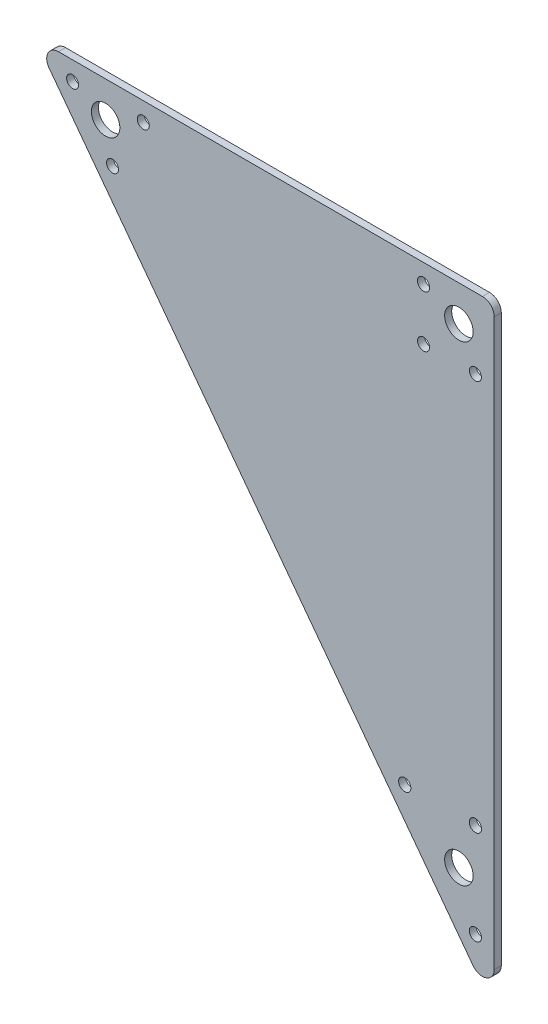
ISO-10303-21;
HEADER;
FILE_DESCRIPTION(('STEP AP214'),'2;1');
FILE_NAME('part.step','',(''),(''),'','','');
FILE_SCHEMA(('AUTOMOTIVE_DESIGN { 1 0 10303 214 1 1 1 1 }'));
ENDSEC;
DATA;
#1=APPLICATION_CONTEXT('core data for automotive mechanical design processes');
#2=APPLICATION_PROTOCOL_DEFINITION('international standard','automotive_design',2000,#1);
#3=PRODUCT_CONTEXT('',#1,'mechanical');
#4=PRODUCT('Part','Part','',(#3));
#5=PRODUCT_RELATED_PRODUCT_CATEGORY('part','',(#4));
#6=PRODUCT_DEFINITION_FORMATION('','',#4);
#7=PRODUCT_DEFINITION_CONTEXT('part definition',#1,'design');
#8=PRODUCT_DEFINITION('design','',#6,#7);
#9=PRODUCT_DEFINITION_SHAPE('','',#8);
#10=(LENGTH_UNIT() NAMED_UNIT(*) SI_UNIT(.MILLI.,.METRE.));
#11=(NAMED_UNIT(*) PLANE_ANGLE_UNIT() SI_UNIT($,.RADIAN.));
#12=(NAMED_UNIT(*) SI_UNIT($,.STERADIAN.) SOLID_ANGLE_UNIT());
#13=UNCERTAINTY_MEASURE_WITH_UNIT(LENGTH_MEASURE(1.E-05),#10,'distance_accuracy_value','');
#14=(GEOMETRIC_REPRESENTATION_CONTEXT(3) GLOBAL_UNCERTAINTY_ASSIGNED_CONTEXT((#13)) GLOBAL_UNIT_ASSIGNED_CONTEXT((#10,
#11,#12)) REPRESENTATION_CONTEXT('',''));
#15=CARTESIAN_POINT('',(0.,0.,0.));
#16=DIRECTION('',(0.,0.,1.));
#17=DIRECTION('',(1.,0.,0.));
#18=AXIS2_PLACEMENT_3D('',#15,#16,#17);
#19=CARTESIAN_POINT('',(0.,0.,3.));
#20=DIRECTION('',(0.,0.,1.));
#21=DIRECTION('',(1.,0.,0.));
#22=AXIS2_PLACEMENT_3D('',#19,#20,#21);
#23=PLANE('',#22);
#24=CARTESIAN_POINT('',(-23.,-181.,3.));
#25=DIRECTION('',(0.,0.,1.));
#26=DIRECTION('',(1.,0.,0.));
#27=AXIS2_PLACEMENT_3D('',#24,#25,#26);
#28=CIRCLE('',#27,2.6);
#29=CARTESIAN_POINT('',(-20.4,-181.,3.));
#30=VERTEX_POINT('',#29);
#31=EDGE_CURVE('E183',#30,#30,#28,.T.);
#32=ORIENTED_EDGE('',*,*,#31,.F.);
#33=EDGE_LOOP('',(#32));
#34=FACE_BOUND('',#33,.T.);
#35=CARTESIAN_POINT('',(-147.048935520436,-15.6014193060854,3.));
#36=DIRECTION('',(0.,0.,1.));
#37=DIRECTION('',(1.,0.,0.));
#38=AXIS2_PLACEMENT_3D('',#35,#36,#37);
#39=CIRCLE('',#38,2.54999999999999);
#40=CARTESIAN_POINT('',(-144.498935520436,-15.6014193060854,3.));
#41=VERTEX_POINT('',#40);
#42=EDGE_CURVE('E195',#41,#41,#39,.T.);
#43=ORIENTED_EDGE('',*,*,#42,.F.);
#44=EDGE_LOOP('',(#43));
#45=FACE_BOUND('',#44,.T.);
#46=CARTESIAN_POINT('',(-164.,7.,3.));
#47=DIRECTION('',(0.,0.,1.));
#48=DIRECTION('',(1.,0.,0.));
#49=AXIS2_PLACEMENT_3D('',#46,#47,#48);
#50=CIRCLE('',#49,2.54999999999999);
#51=CARTESIAN_POINT('',(-161.45,7.,3.));
#52=VERTEX_POINT('',#51);
#53=EDGE_CURVE('E205',#52,#52,#50,.T.);
#54=ORIENTED_EDGE('',*,*,#53,.F.);
#55=EDGE_LOOP('',(#54));
#56=FACE_BOUND('',#55,.T.);
#57=CARTESIAN_POINT('',(-15.,-15.,3.));
#58=DIRECTION('',(0.,0.,1.));
#59=DIRECTION('',(1.,0.,0.));
#60=AXIS2_PLACEMENT_3D('',#57,#58,#59);
#61=CIRCLE('',#60,2.54999999999999);
#62=CARTESIAN_POINT('',(-12.45,-15.,3.));
#63=VERTEX_POINT('',#62);
#64=EDGE_CURVE('E215',#63,#63,#61,.T.);
#65=ORIENTED_EDGE('',*,*,#64,.F.);
#66=EDGE_LOOP('',(#65));
#67=FACE_BOUND('',#66,.T.);
#68=CARTESIAN_POINT('',(0.,-200.,3.));
#69=DIRECTION('',(0.,0.,1.));
#70=DIRECTION('',(1.,0.,0.));
#71=AXIS2_PLACEMENT_3D('',#68,#69,#70);
#72=CIRCLE('',#71,6.05);
#73=CARTESIAN_POINT('',(6.05000000000002,-200.,3.));
#74=VERTEX_POINT('',#73);
#75=EDGE_CURVE('E225',#74,#74,#72,.T.);
#76=ORIENTED_EDGE('',*,*,#75,.F.);
#77=EDGE_LOOP('',(#76));
#78=FACE_BOUND('',#77,.T.);
#79=CARTESIAN_POINT('',(0.,0.,3.));
#80=DIRECTION('',(0.,0.,1.));
#81=DIRECTION('',(1.,0.,0.));
#82=AXIS2_PLACEMENT_3D('',#79,#80,#81);
#83=CIRCLE('',#82,6.05);
#84=CARTESIAN_POINT('',(6.05,0.,3.));
#85=VERTEX_POINT('',#84);
#86=EDGE_CURVE('E119',#85,#85,#83,.T.);
#87=ORIENTED_EDGE('',*,*,#86,.F.);
#88=EDGE_LOOP('',(#87));
#89=FACE_BOUND('',#88,.T.);
#90=DIRECTION('',(0.6,-0.8,0.));
#91=VECTOR('',#90,1.);
#92=CARTESIAN_POINT('',(-180.,15.,3.));
#93=LINE('',#92,#91);
#94=CARTESIAN_POINT('',(-174.,6.99999999999999,3.));
#95=VERTEX_POINT('',#94);
#96=CARTESIAN_POINT('',(6.00000000000006,-233.,3.));
#97=VERTEX_POINT('',#96);
#98=EDGE_CURVE('E117',#95,#97,#93,.T.);
#99=ORIENTED_EDGE('',*,*,#98,.T.);
#100=CARTESIAN_POINT('',(10.,-230.,3.));
#101=DIRECTION('',(0.,0.,1.));
#102=DIRECTION('',(1.,0.,0.));
#103=AXIS2_PLACEMENT_3D('',#100,#101,#102);
#104=CIRCLE('',#103,5.);
#105=CARTESIAN_POINT('',(15.,-230.,3.));
#106=VERTEX_POINT('',#105);
#107=EDGE_CURVE('E133',#97,#106,#104,.T.);
#108=ORIENTED_EDGE('',*,*,#107,.T.);
#109=DIRECTION('',(0.,1.,0.));
#110=VECTOR('',#109,1.);
#111=CARTESIAN_POINT('',(15.,15.,3.));
#112=LINE('',#111,#110);
#113=CARTESIAN_POINT('',(15.,10.,3.));
#114=VERTEX_POINT('',#113);
#115=EDGE_CURVE('E107',#106,#114,#112,.T.);
#116=ORIENTED_EDGE('',*,*,#115,.T.);
#117=CARTESIAN_POINT('',(9.99999999999998,10.,3.));
#118=DIRECTION('',(0.,0.,1.));
#119=DIRECTION('',(1.,0.,0.));
#120=AXIS2_PLACEMENT_3D('',#117,#118,#119);
#121=CIRCLE('',#120,5.);
#122=CARTESIAN_POINT('',(9.99999999999998,15.,3.));
#123=VERTEX_POINT('',#122);
#124=EDGE_CURVE('E55',#114,#123,#121,.T.);
#125=ORIENTED_EDGE('',*,*,#124,.T.);
#126=DIRECTION('',(-1.,0.,0.));
#127=VECTOR('',#126,1.);
#128=CARTESIAN_POINT('',(-180.,15.,3.));
#129=LINE('',#128,#127);
#130=CARTESIAN_POINT('',(-170.,15.,3.));
#131=VERTEX_POINT('',#130);
#132=EDGE_CURVE('E123',#123,#131,#129,.T.);
#133=ORIENTED_EDGE('',*,*,#132,.T.);
#134=CARTESIAN_POINT('',(-170.,10.,3.));
#135=DIRECTION('',(0.,0.,1.));
#136=DIRECTION('',(1.,0.,0.));
#137=AXIS2_PLACEMENT_3D('',#134,#135,#136);
#138=CIRCLE('',#137,5.);
#139=EDGE_CURVE('E131',#131,#95,#138,.T.);
#140=ORIENTED_EDGE('',*,*,#139,.T.);
#141=EDGE_LOOP('',(#99,#108,#116,#125,#133,#140));
#142=FACE_BOUND('',#141,.T.);
#143=CARTESIAN_POINT('',(-150.,0.,3.));
#144=DIRECTION('',(0.,0.,1.));
#145=DIRECTION('',(1.,0.,0.));
#146=AXIS2_PLACEMENT_3D('',#143,#144,#145);
#147=CIRCLE('',#146,6.05000000000001);
#148=CARTESIAN_POINT('',(-143.95,0.,3.));
#149=VERTEX_POINT('',#148);
#150=EDGE_CURVE('E158',#149,#149,#147,.T.);
#151=ORIENTED_EDGE('',*,*,#150,.F.);
#152=EDGE_LOOP('',(#151));
#153=FACE_BOUND('',#152,.T.);
#154=CARTESIAN_POINT('',(-15.,7.,3.));
#155=DIRECTION('',(0.,0.,1.));
#156=DIRECTION('',(1.,0.,0.));
#157=AXIS2_PLACEMENT_3D('',#154,#155,#156);
#158=CIRCLE('',#157,2.6);
#159=CARTESIAN_POINT('',(-12.4,7.,3.));
#160=VERTEX_POINT('',#159);
#161=EDGE_CURVE('E162',#160,#160,#158,.T.);
#162=ORIENTED_EDGE('',*,*,#161,.F.);
#163=EDGE_LOOP('',(#162));
#164=FACE_BOUND('',#163,.T.);
#165=CARTESIAN_POINT('',(7.,-15.,3.));
#166=DIRECTION('',(0.,0.,1.));
#167=DIRECTION('',(1.,0.,0.));
#168=AXIS2_PLACEMENT_3D('',#165,#166,#167);
#169=CIRCLE('',#168,2.55);
#170=CARTESIAN_POINT('',(9.55,-15.,3.));
#171=VERTEX_POINT('',#170);
#172=EDGE_CURVE('E166',#171,#171,#169,.T.);
#173=ORIENTED_EDGE('',*,*,#172,.F.);
#174=EDGE_LOOP('',(#173));
#175=FACE_BOUND('',#174,.T.);
#176=CARTESIAN_POINT('',(-134.,7.,3.));
#177=DIRECTION('',(0.,0.,1.));
#178=DIRECTION('',(1.,0.,0.));
#179=AXIS2_PLACEMENT_3D('',#176,#177,#178);
#180=CIRCLE('',#179,2.54999999999999);
#181=CARTESIAN_POINT('',(-131.45,7.,3.));
#182=VERTEX_POINT('',#181);
#183=EDGE_CURVE('E170',#182,#182,#180,.T.);
#184=ORIENTED_EDGE('',*,*,#183,.F.);
#185=EDGE_LOOP('',(#184));
#186=FACE_BOUND('',#185,.T.);
#187=CARTESIAN_POINT('',(7.00000000000002,-221.,3.));
#188=DIRECTION('',(0.,0.,1.));
#189=DIRECTION('',(1.,0.,0.));
#190=AXIS2_PLACEMENT_3D('',#187,#188,#189);
#191=CIRCLE('',#190,2.6);
#192=CARTESIAN_POINT('',(9.60000000000002,-221.,3.));
#193=VERTEX_POINT('',#192);
#194=EDGE_CURVE('E174',#193,#193,#191,.T.);
#195=ORIENTED_EDGE('',*,*,#194,.F.);
#196=EDGE_LOOP('',(#195));
#197=FACE_BOUND('',#196,.T.);
#198=CARTESIAN_POINT('',(7.00000000000003,-181.,3.));
#199=DIRECTION('',(0.,0.,1.));
#200=DIRECTION('',(1.,0.,0.));
#201=AXIS2_PLACEMENT_3D('',#198,#199,#200);
#202=CIRCLE('',#201,2.6);
#203=CARTESIAN_POINT('',(9.60000000000002,-181.,3.));
#204=VERTEX_POINT('',#203);
#205=EDGE_CURVE('E177',#204,#204,#202,.T.);
#206=ORIENTED_EDGE('',*,*,#205,.F.);
#207=EDGE_LOOP('',(#206));
#208=FACE_BOUND('',#207,.T.);
#209=ADVANCED_FACE('F35',(#34,#45,#56,#67,#78,#89,#142,#153,#164,#175,#186,#197,#208),#23,.T.);
#210=CARTESIAN_POINT('',(0.,0.,0.));
#211=DIRECTION('',(0.,0.,1.));
#212=DIRECTION('',(1.,0.,0.));
#213=AXIS2_PLACEMENT_3D('',#210,#211,#212);
#214=PLANE('',#213);
#215=DIRECTION('',(0.,1.,0.));
#216=VECTOR('',#215,1.);
#217=CARTESIAN_POINT('',(15.,15.,0.));
#218=LINE('',#217,#216);
#219=CARTESIAN_POINT('',(15.,-230.,0.));
#220=VERTEX_POINT('',#219);
#221=CARTESIAN_POINT('',(15.,10.,0.));
#222=VERTEX_POINT('',#221);
#223=EDGE_CURVE('E105',#220,#222,#218,.T.);
#224=ORIENTED_EDGE('',*,*,#223,.F.);
#225=CARTESIAN_POINT('',(10.,-230.,0.));
#226=DIRECTION('',(0.,0.,1.));
#227=DIRECTION('',(1.,0.,0.));
#228=AXIS2_PLACEMENT_3D('',#225,#226,#227);
#229=CIRCLE('',#228,5.);
#230=CARTESIAN_POINT('',(6.00000000000006,-233.,0.));
#231=VERTEX_POINT('',#230);
#232=EDGE_CURVE('E88',#220,#231,#229,.F.);
#233=ORIENTED_EDGE('',*,*,#232,.T.);
#234=DIRECTION('',(0.6,-0.8,0.));
#235=VECTOR('',#234,1.);
#236=CARTESIAN_POINT('',(-180.,15.,0.));
#237=LINE('',#236,#235);
#238=CARTESIAN_POINT('',(-174.,6.99999999999999,0.));
#239=VERTEX_POINT('',#238);
#240=EDGE_CURVE('E115',#239,#231,#237,.T.);
#241=ORIENTED_EDGE('',*,*,#240,.F.);
#242=CARTESIAN_POINT('',(-170.,10.,0.));
#243=DIRECTION('',(0.,0.,1.));
#244=DIRECTION('',(1.,0.,0.));
#245=AXIS2_PLACEMENT_3D('',#242,#243,#244);
#246=CIRCLE('',#245,5.);
#247=CARTESIAN_POINT('',(-170.,15.,0.));
#248=VERTEX_POINT('',#247);
#249=EDGE_CURVE('E99',#239,#248,#246,.F.);
#250=ORIENTED_EDGE('',*,*,#249,.T.);
#251=DIRECTION('',(-1.,0.,0.));
#252=VECTOR('',#251,1.);
#253=CARTESIAN_POINT('',(-180.,15.,0.));
#254=LINE('',#253,#252);
#255=CARTESIAN_POINT('',(9.99999999999998,15.,0.));
#256=VERTEX_POINT('',#255);
#257=EDGE_CURVE('E114',#256,#248,#254,.T.);
#258=ORIENTED_EDGE('',*,*,#257,.F.);
#259=CARTESIAN_POINT('',(9.99999999999998,10.,0.));
#260=DIRECTION('',(0.,0.,1.));
#261=DIRECTION('',(1.,0.,0.));
#262=AXIS2_PLACEMENT_3D('',#259,#260,#261);
#263=CIRCLE('',#262,5.);
#264=EDGE_CURVE('E108',#256,#222,#263,.F.);
#265=ORIENTED_EDGE('',*,*,#264,.T.);
#266=EDGE_LOOP('',(#224,#233,#241,#250,#258,#265));
#267=FACE_BOUND('',#266,.T.);
#268=CARTESIAN_POINT('',(0.,0.,0.));
#269=DIRECTION('',(0.,0.,1.));
#270=DIRECTION('',(1.,0.,0.));
#271=AXIS2_PLACEMENT_3D('',#268,#269,#270);
#272=CIRCLE('',#271,6.05);
#273=CARTESIAN_POINT('',(6.05,0.,0.));
#274=VERTEX_POINT('',#273);
#275=EDGE_CURVE('E149',#274,#274,#272,.T.);
#276=ORIENTED_EDGE('',*,*,#275,.T.);
#277=EDGE_LOOP('',(#276));
#278=FACE_BOUND('',#277,.T.);
#279=CARTESIAN_POINT('',(-150.,0.,0.));
#280=DIRECTION('',(0.,0.,1.));
#281=DIRECTION('',(1.,0.,0.));
#282=AXIS2_PLACEMENT_3D('',#279,#280,#281);
#283=CIRCLE('',#282,6.05000000000001);
#284=CARTESIAN_POINT('',(-143.95,0.,0.));
#285=VERTEX_POINT('',#284);
#286=EDGE_CURVE('E228',#285,#285,#283,.T.);
#287=ORIENTED_EDGE('',*,*,#286,.T.);
#288=EDGE_LOOP('',(#287));
#289=FACE_BOUND('',#288,.T.);
#290=CARTESIAN_POINT('',(0.,-200.,0.));
#291=DIRECTION('',(0.,0.,1.));
#292=DIRECTION('',(1.,0.,0.));
#293=AXIS2_PLACEMENT_3D('',#290,#291,#292);
#294=CIRCLE('',#293,6.05);
#295=CARTESIAN_POINT('',(6.05000000000002,-200.,0.));
#296=VERTEX_POINT('',#295);
#297=EDGE_CURVE('E222',#296,#296,#294,.T.);
#298=ORIENTED_EDGE('',*,*,#297,.T.);
#299=EDGE_LOOP('',(#298));
#300=FACE_BOUND('',#299,.T.);
#301=CARTESIAN_POINT('',(-15.,7.,0.));
#302=DIRECTION('',(0.,0.,1.));
#303=DIRECTION('',(1.,0.,0.));
#304=AXIS2_PLACEMENT_3D('',#301,#302,#303);
#305=CIRCLE('',#304,2.6);
#306=CARTESIAN_POINT('',(-12.4,7.,0.));
#307=VERTEX_POINT('',#306);
#308=EDGE_CURVE('E218',#307,#307,#305,.T.);
#309=ORIENTED_EDGE('',*,*,#308,.T.);
#310=EDGE_LOOP('',(#309));
#311=FACE_BOUND('',#310,.T.);
#312=CARTESIAN_POINT('',(-15.,-15.,0.));
#313=DIRECTION('',(0.,0.,1.));
#314=DIRECTION('',(1.,0.,0.));
#315=AXIS2_PLACEMENT_3D('',#312,#313,#314);
#316=CIRCLE('',#315,2.54999999999999);
#317=CARTESIAN_POINT('',(-12.45,-15.,0.));
#318=VERTEX_POINT('',#317);
#319=EDGE_CURVE('E212',#318,#318,#316,.T.);
#320=ORIENTED_EDGE('',*,*,#319,.T.);
#321=EDGE_LOOP('',(#320));
#322=FACE_BOUND('',#321,.T.);
#323=CARTESIAN_POINT('',(7.,-15.,0.));
#324=DIRECTION('',(0.,0.,1.));
#325=DIRECTION('',(1.,0.,0.));
#326=AXIS2_PLACEMENT_3D('',#323,#324,#325);
#327=CIRCLE('',#326,2.55);
#328=CARTESIAN_POINT('',(9.55,-15.,0.));
#329=VERTEX_POINT('',#328);
#330=EDGE_CURVE('E208',#329,#329,#327,.T.);
#331=ORIENTED_EDGE('',*,*,#330,.T.);
#332=EDGE_LOOP('',(#331));
#333=FACE_BOUND('',#332,.T.);
#334=CARTESIAN_POINT('',(-164.,7.,0.));
#335=DIRECTION('',(0.,0.,1.));
#336=DIRECTION('',(1.,0.,0.));
#337=AXIS2_PLACEMENT_3D('',#334,#335,#336);
#338=CIRCLE('',#337,2.54999999999999);
#339=CARTESIAN_POINT('',(-161.45,7.,0.));
#340=VERTEX_POINT('',#339);
#341=EDGE_CURVE('E202',#340,#340,#338,.T.);
#342=ORIENTED_EDGE('',*,*,#341,.T.);
#343=EDGE_LOOP('',(#342));
#344=FACE_BOUND('',#343,.T.);
#345=CARTESIAN_POINT('',(-134.,7.,0.));
#346=DIRECTION('',(0.,0.,1.));
#347=DIRECTION('',(1.,0.,0.));
#348=AXIS2_PLACEMENT_3D('',#345,#346,#347);
#349=CIRCLE('',#348,2.54999999999999);
#350=CARTESIAN_POINT('',(-131.45,7.,0.));
#351=VERTEX_POINT('',#350);
#352=EDGE_CURVE('E198',#351,#351,#349,.T.);
#353=ORIENTED_EDGE('',*,*,#352,.T.);
#354=EDGE_LOOP('',(#353));
#355=FACE_BOUND('',#354,.T.);
#356=CARTESIAN_POINT('',(-147.048935520436,-15.6014193060854,0.));
#357=DIRECTION('',(0.,0.,1.));
#358=DIRECTION('',(1.,0.,0.));
#359=AXIS2_PLACEMENT_3D('',#356,#357,#358);
#360=CIRCLE('',#359,2.54999999999999);
#361=CARTESIAN_POINT('',(-144.498935520436,-15.6014193060854,0.));
#362=VERTEX_POINT('',#361);
#363=EDGE_CURVE('E192',#362,#362,#360,.T.);
#364=ORIENTED_EDGE('',*,*,#363,.T.);
#365=EDGE_LOOP('',(#364));
#366=FACE_BOUND('',#365,.T.);
#367=CARTESIAN_POINT('',(7.00000000000002,-221.,0.));
#368=DIRECTION('',(0.,0.,1.));
#369=DIRECTION('',(1.,0.,0.));
#370=AXIS2_PLACEMENT_3D('',#367,#368,#369);
#371=CIRCLE('',#370,2.6);
#372=CARTESIAN_POINT('',(9.60000000000002,-221.,0.));
#373=VERTEX_POINT('',#372);
#374=EDGE_CURVE('E189',#373,#373,#371,.T.);
#375=ORIENTED_EDGE('',*,*,#374,.T.);
#376=EDGE_LOOP('',(#375));
#377=FACE_BOUND('',#376,.T.);
#378=CARTESIAN_POINT('',(-23.,-181.,0.));
#379=DIRECTION('',(0.,0.,1.));
#380=DIRECTION('',(1.,0.,0.));
#381=AXIS2_PLACEMENT_3D('',#378,#379,#380);
#382=CIRCLE('',#381,2.6);
#383=CARTESIAN_POINT('',(-20.4,-181.,0.));
#384=VERTEX_POINT('',#383);
#385=EDGE_CURVE('E179',#384,#384,#382,.T.);
#386=ORIENTED_EDGE('',*,*,#385,.T.);
#387=EDGE_LOOP('',(#386));
#388=FACE_BOUND('',#387,.T.);
#389=CARTESIAN_POINT('',(7.00000000000003,-181.,0.));
#390=DIRECTION('',(0.,0.,1.));
#391=DIRECTION('',(1.,0.,0.));
#392=AXIS2_PLACEMENT_3D('',#389,#390,#391);
#393=CIRCLE('',#392,2.6);
#394=CARTESIAN_POINT('',(9.60000000000002,-181.,0.));
#395=VERTEX_POINT('',#394);
#396=EDGE_CURVE('E180',#395,#395,#393,.T.);
#397=ORIENTED_EDGE('',*,*,#396,.T.);
#398=EDGE_LOOP('',(#397));
#399=FACE_BOUND('',#398,.T.);
#400=ADVANCED_FACE('F111',(#267,#278,#289,#300,#311,#322,#333,#344,#355,#366,#377,#388,#399),
#214,.F.);
#401=CARTESIAN_POINT('',(-180.,15.,3.));
#402=DIRECTION('',(0.8,0.6,0.));
#403=DIRECTION('',(-0.6,0.8,0.));
#404=AXIS2_PLACEMENT_3D('',#401,#402,#403);
#405=PLANE('',#404);
#406=ORIENTED_EDGE('',*,*,#240,.T.);
#407=DIRECTION('',(0.,0.,-1.));
#408=VECTOR('',#407,1.);
#409=CARTESIAN_POINT('',(6.00000000000001,-233.,3.));
#410=LINE('',#409,#408);
#411=EDGE_CURVE('E93',#231,#97,#410,.F.);
#412=ORIENTED_EDGE('',*,*,#411,.T.);
#413=ORIENTED_EDGE('',*,*,#98,.F.);
#414=DIRECTION('',(0.,0.,-1.));
#415=VECTOR('',#414,1.);
#416=CARTESIAN_POINT('',(-174.,7.,3.));
#417=LINE('',#416,#415);
#418=EDGE_CURVE('E98',#95,#239,#417,.T.);
#419=ORIENTED_EDGE('',*,*,#418,.T.);
#420=EDGE_LOOP('',(#406,#412,#413,#419));
#421=FACE_BOUND('',#420,.T.);
#422=ADVANCED_FACE('F144',(#421),#405,.F.);
#423=CARTESIAN_POINT('',(15.,15.,3.));
#424=DIRECTION('',(-1.,0.,0.));
#425=DIRECTION('',(0.,-1.,0.));
#426=AXIS2_PLACEMENT_3D('',#423,#424,#425);
#427=PLANE('',#426);
#428=ORIENTED_EDGE('',*,*,#115,.F.);
#429=DIRECTION('',(0.,0.,-1.));
#430=VECTOR('',#429,1.);
#431=CARTESIAN_POINT('',(15.,-230.,3.));
#432=LINE('',#431,#430);
#433=EDGE_CURVE('E92',#106,#220,#432,.T.);
#434=ORIENTED_EDGE('',*,*,#433,.T.);
#435=ORIENTED_EDGE('',*,*,#223,.T.);
#436=DIRECTION('',(0.,0.,-1.));
#437=VECTOR('',#436,1.);
#438=CARTESIAN_POINT('',(15.,10.,3.));
#439=LINE('',#438,#437);
#440=EDGE_CURVE('E109',#222,#114,#439,.F.);
#441=ORIENTED_EDGE('',*,*,#440,.T.);
#442=EDGE_LOOP('',(#428,#434,#435,#441));
#443=FACE_BOUND('',#442,.T.);
#444=ADVANCED_FACE('F104',(#443),#427,.F.);
#445=CARTESIAN_POINT('',(-180.,15.,3.));
#446=DIRECTION('',(0.,-1.,0.));
#447=DIRECTION('',(0.,0.,-1.));
#448=AXIS2_PLACEMENT_3D('',#445,#446,#447);
#449=PLANE('',#448);
#450=ORIENTED_EDGE('',*,*,#257,.T.);
#451=DIRECTION('',(0.,0.,-1.));
#452=VECTOR('',#451,1.);
#453=CARTESIAN_POINT('',(-170.,15.,3.));
#454=LINE('',#453,#452);
#455=EDGE_CURVE('E11',#248,#131,#454,.F.);
#456=ORIENTED_EDGE('',*,*,#455,.T.);
#457=ORIENTED_EDGE('',*,*,#132,.F.);
#458=DIRECTION('',(0.,0.,-1.));
#459=VECTOR('',#458,1.);
#460=CARTESIAN_POINT('',(9.99999999999998,15.,3.));
#461=LINE('',#460,#459);
#462=EDGE_CURVE('E43',#123,#256,#461,.T.);
#463=ORIENTED_EDGE('',*,*,#462,.T.);
#464=EDGE_LOOP('',(#450,#456,#457,#463));
#465=FACE_BOUND('',#464,.T.);
#466=ADVANCED_FACE('F136',(#465),#449,.F.);
#467=CARTESIAN_POINT('',(0.,0.,3.));
#468=DIRECTION('',(0.,0.,-1.));
#469=DIRECTION('',(-1.,0.,0.));
#470=AXIS2_PLACEMENT_3D('',#467,#468,#469);
#471=CYLINDRICAL_SURFACE('',#470,6.05);
#472=ORIENTED_EDGE('',*,*,#86,.T.);
#473=EDGE_LOOP('',(#472));
#474=FACE_BOUND('',#473,.T.);
#475=ORIENTED_EDGE('',*,*,#275,.F.);
#476=EDGE_LOOP('',(#475));
#477=FACE_BOUND('',#476,.T.);
#478=ADVANCED_FACE('F240',(#474,#477),#471,.F.);
#479=CARTESIAN_POINT('',(-150.,0.,3.));
#480=DIRECTION('',(0.,0.,-1.));
#481=DIRECTION('',(-1.,0.,0.));
#482=AXIS2_PLACEMENT_3D('',#479,#480,#481);
#483=CYLINDRICAL_SURFACE('',#482,6.05000000000001);
#484=ORIENTED_EDGE('',*,*,#150,.T.);
#485=EDGE_LOOP('',(#484));
#486=FACE_BOUND('',#485,.T.);
#487=ORIENTED_EDGE('',*,*,#286,.F.);
#488=EDGE_LOOP('',(#487));
#489=FACE_BOUND('',#488,.T.);
#490=ADVANCED_FACE('F242',(#486,#489),#483,.F.);
#491=CARTESIAN_POINT('',(0.,-200.,3.));
#492=DIRECTION('',(0.,0.,-1.));
#493=DIRECTION('',(-1.,0.,0.));
#494=AXIS2_PLACEMENT_3D('',#491,#492,#493);
#495=CYLINDRICAL_SURFACE('',#494,6.05);
#496=ORIENTED_EDGE('',*,*,#75,.T.);
#497=EDGE_LOOP('',(#496));
#498=FACE_BOUND('',#497,.T.);
#499=ORIENTED_EDGE('',*,*,#297,.F.);
#500=EDGE_LOOP('',(#499));
#501=FACE_BOUND('',#500,.T.);
#502=ADVANCED_FACE('F248',(#498,#501),#495,.F.);
#503=CARTESIAN_POINT('',(-15.,7.,3.));
#504=DIRECTION('',(0.,0.,-1.));
#505=DIRECTION('',(-1.,0.,0.));
#506=AXIS2_PLACEMENT_3D('',#503,#504,#505);
#507=CYLINDRICAL_SURFACE('',#506,2.6);
#508=ORIENTED_EDGE('',*,*,#161,.T.);
#509=EDGE_LOOP('',(#508));
#510=FACE_BOUND('',#509,.T.);
#511=ORIENTED_EDGE('',*,*,#308,.F.);
#512=EDGE_LOOP('',(#511));
#513=FACE_BOUND('',#512,.T.);
#514=ADVANCED_FACE('F387',(#510,#513),#507,.F.);
#515=CARTESIAN_POINT('',(-15.,-15.,3.));
#516=DIRECTION('',(0.,0.,-1.));
#517=DIRECTION('',(-1.,0.,0.));
#518=AXIS2_PLACEMENT_3D('',#515,#516,#517);
#519=CYLINDRICAL_SURFACE('',#518,2.54999999999999);
#520=ORIENTED_EDGE('',*,*,#64,.T.);
#521=EDGE_LOOP('',(#520));
#522=FACE_BOUND('',#521,.T.);
#523=ORIENTED_EDGE('',*,*,#319,.F.);
#524=EDGE_LOOP('',(#523));
#525=FACE_BOUND('',#524,.T.);
#526=ADVANCED_FACE('F377',(#522,#525),#519,.F.);
#527=CARTESIAN_POINT('',(7.,-15.,3.));
#528=DIRECTION('',(0.,0.,-1.));
#529=DIRECTION('',(-1.,0.,0.));
#530=AXIS2_PLACEMENT_3D('',#527,#528,#529);
#531=CYLINDRICAL_SURFACE('',#530,2.55);
#532=ORIENTED_EDGE('',*,*,#172,.T.);
#533=EDGE_LOOP('',(#532));
#534=FACE_BOUND('',#533,.T.);
#535=ORIENTED_EDGE('',*,*,#330,.F.);
#536=EDGE_LOOP('',(#535));
#537=FACE_BOUND('',#536,.T.);
#538=ADVANCED_FACE('F367',(#534,#537),#531,.F.);
#539=CARTESIAN_POINT('',(-164.,7.,3.));
#540=DIRECTION('',(0.,0.,-1.));
#541=DIRECTION('',(-1.,0.,0.));
#542=AXIS2_PLACEMENT_3D('',#539,#540,#541);
#543=CYLINDRICAL_SURFACE('',#542,2.54999999999999);
#544=ORIENTED_EDGE('',*,*,#53,.T.);
#545=EDGE_LOOP('',(#544));
#546=FACE_BOUND('',#545,.T.);
#547=ORIENTED_EDGE('',*,*,#341,.F.);
#548=EDGE_LOOP('',(#547));
#549=FACE_BOUND('',#548,.T.);
#550=ADVANCED_FACE('F357',(#546,#549),#543,.F.);
#551=CARTESIAN_POINT('',(-134.,7.,3.));
#552=DIRECTION('',(0.,0.,-1.));
#553=DIRECTION('',(-1.,0.,0.));
#554=AXIS2_PLACEMENT_3D('',#551,#552,#553);
#555=CYLINDRICAL_SURFACE('',#554,2.54999999999999);
#556=ORIENTED_EDGE('',*,*,#183,.T.);
#557=EDGE_LOOP('',(#556));
#558=FACE_BOUND('',#557,.T.);
#559=ORIENTED_EDGE('',*,*,#352,.F.);
#560=EDGE_LOOP('',(#559));
#561=FACE_BOUND('',#560,.T.);
#562=ADVANCED_FACE('F347',(#558,#561),#555,.F.);
#563=CARTESIAN_POINT('',(-147.048935520436,-15.6014193060854,3.));
#564=DIRECTION('',(0.,0.,-1.));
#565=DIRECTION('',(-1.,0.,0.));
#566=AXIS2_PLACEMENT_3D('',#563,#564,#565);
#567=CYLINDRICAL_SURFACE('',#566,2.54999999999999);
#568=ORIENTED_EDGE('',*,*,#42,.T.);
#569=EDGE_LOOP('',(#568));
#570=FACE_BOUND('',#569,.T.);
#571=ORIENTED_EDGE('',*,*,#363,.F.);
#572=EDGE_LOOP('',(#571));
#573=FACE_BOUND('',#572,.T.);
#574=ADVANCED_FACE('F337',(#570,#573),#567,.F.);
#575=CARTESIAN_POINT('',(7.00000000000002,-221.,3.));
#576=DIRECTION('',(0.,0.,-1.));
#577=DIRECTION('',(-1.,0.,0.));
#578=AXIS2_PLACEMENT_3D('',#575,#576,#577);
#579=CYLINDRICAL_SURFACE('',#578,2.6);
#580=ORIENTED_EDGE('',*,*,#194,.T.);
#581=EDGE_LOOP('',(#580));
#582=FACE_BOUND('',#581,.T.);
#583=ORIENTED_EDGE('',*,*,#374,.F.);
#584=EDGE_LOOP('',(#583));
#585=FACE_BOUND('',#584,.T.);
#586=ADVANCED_FACE('F327',(#582,#585),#579,.F.);
#587=CARTESIAN_POINT('',(-23.,-181.,3.));
#588=DIRECTION('',(0.,0.,-1.));
#589=DIRECTION('',(-1.,0.,0.));
#590=AXIS2_PLACEMENT_3D('',#587,#588,#589);
#591=CYLINDRICAL_SURFACE('',#590,2.6);
#592=ORIENTED_EDGE('',*,*,#31,.T.);
#593=EDGE_LOOP('',(#592));
#594=FACE_BOUND('',#593,.T.);
#595=ORIENTED_EDGE('',*,*,#385,.F.);
#596=EDGE_LOOP('',(#595));
#597=FACE_BOUND('',#596,.T.);
#598=ADVANCED_FACE('F318',(#594,#597),#591,.F.);
#599=CARTESIAN_POINT('',(7.00000000000003,-181.,3.));
#600=DIRECTION('',(0.,0.,-1.));
#601=DIRECTION('',(-1.,0.,0.));
#602=AXIS2_PLACEMENT_3D('',#599,#600,#601);
#603=CYLINDRICAL_SURFACE('',#602,2.6);
#604=ORIENTED_EDGE('',*,*,#205,.T.);
#605=EDGE_LOOP('',(#604));
#606=FACE_BOUND('',#605,.T.);
#607=ORIENTED_EDGE('',*,*,#396,.F.);
#608=EDGE_LOOP('',(#607));
#609=FACE_BOUND('',#608,.T.);
#610=ADVANCED_FACE('F261',(#606,#609),#603,.F.);
#611=CARTESIAN_POINT('',(10.,-230.,3.));
#612=DIRECTION('',(0.,0.,-1.));
#613=DIRECTION('',(-1.,0.,0.));
#614=AXIS2_PLACEMENT_3D('',#611,#612,#613);
#615=CYLINDRICAL_SURFACE('',#614,5.);
#616=ORIENTED_EDGE('',*,*,#107,.F.);
#617=ORIENTED_EDGE('',*,*,#411,.F.);
#618=ORIENTED_EDGE('',*,*,#232,.F.);
#619=ORIENTED_EDGE('',*,*,#433,.F.);
#620=EDGE_LOOP('',(#616,#617,#618,#619));
#621=FACE_BOUND('',#620,.T.);
#622=ADVANCED_FACE('F91',(#621),#615,.T.);
#623=CARTESIAN_POINT('',(-170.,10.,3.));
#624=DIRECTION('',(0.,0.,-1.));
#625=DIRECTION('',(-1.,0.,0.));
#626=AXIS2_PLACEMENT_3D('',#623,#624,#625);
#627=CYLINDRICAL_SURFACE('',#626,5.);
#628=ORIENTED_EDGE('',*,*,#139,.F.);
#629=ORIENTED_EDGE('',*,*,#455,.F.);
#630=ORIENTED_EDGE('',*,*,#249,.F.);
#631=ORIENTED_EDGE('',*,*,#418,.F.);
#632=EDGE_LOOP('',(#628,#629,#630,#631));
#633=FACE_BOUND('',#632,.T.);
#634=ADVANCED_FACE('F141',(#633),#627,.T.);
#635=CARTESIAN_POINT('',(9.99999999999998,10.,3.));
#636=DIRECTION('',(0.,0.,-1.));
#637=DIRECTION('',(-1.,0.,0.));
#638=AXIS2_PLACEMENT_3D('',#635,#636,#637);
#639=CYLINDRICAL_SURFACE('',#638,5.);
#640=ORIENTED_EDGE('',*,*,#124,.F.);
#641=ORIENTED_EDGE('',*,*,#440,.F.);
#642=ORIENTED_EDGE('',*,*,#264,.F.);
#643=ORIENTED_EDGE('',*,*,#462,.F.);
#644=EDGE_LOOP('',(#640,#641,#642,#643));
#645=FACE_BOUND('',#644,.T.);
#646=ADVANCED_FACE('F37',(#645),#639,.T.);
#647=CLOSED_SHELL('',(#209,#400,#422,#444,#466,#478,#490,#502,#514,#526,#538,#550,#562,#574,
#586,#598,#610,#622,#634,#646));
#648=MANIFOLD_SOLID_BREP('B2',#647);
#649=ADVANCED_BREP_SHAPE_REPRESENTATION('',(#18,#648),#14);
#650=SHAPE_DEFINITION_REPRESENTATION(#9,#649);
ENDSEC;
END-ISO-10303-21;
